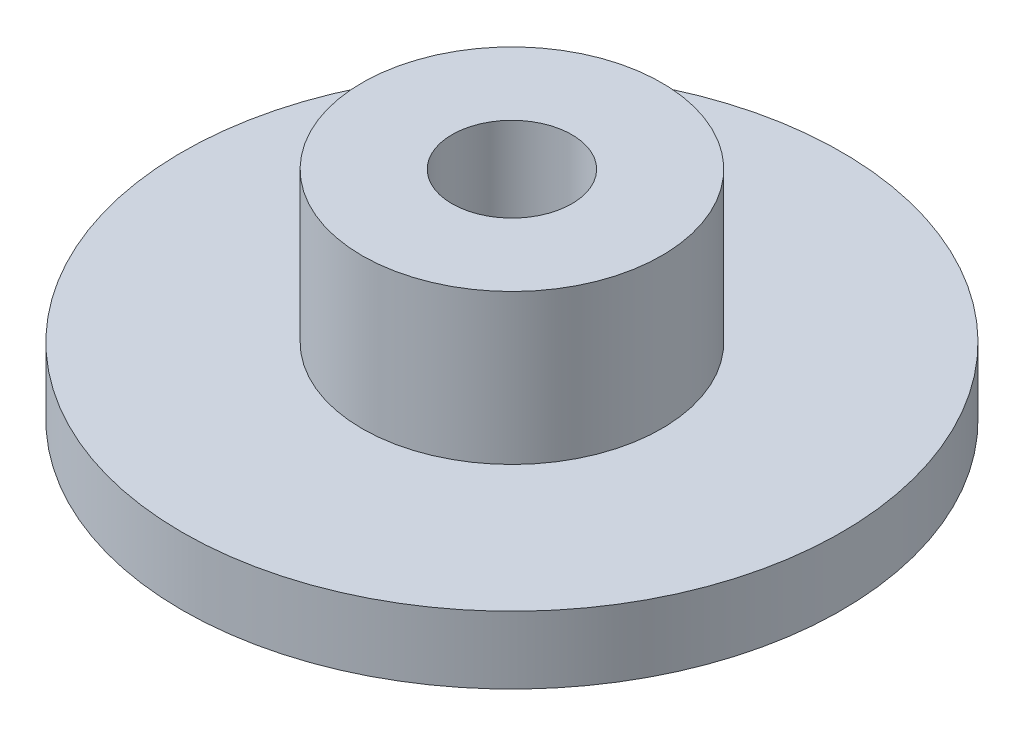
ISO-10303-21;
HEADER;
FILE_DESCRIPTION(('STEP AP214'),'2;1');
FILE_NAME('part.step','',(''),(''),'','','');
FILE_SCHEMA(('AUTOMOTIVE_DESIGN { 1 0 10303 214 1 1 1 1 }'));
ENDSEC;
DATA;
#1=APPLICATION_CONTEXT('core data for automotive mechanical design processes');
#2=APPLICATION_PROTOCOL_DEFINITION('international standard','automotive_design',2000,#1);
#3=PRODUCT_CONTEXT('',#1,'mechanical');
#4=PRODUCT('Part','Part','',(#3));
#5=PRODUCT_RELATED_PRODUCT_CATEGORY('part','',(#4));
#6=PRODUCT_DEFINITION_FORMATION('','',#4);
#7=PRODUCT_DEFINITION_CONTEXT('part definition',#1,'design');
#8=PRODUCT_DEFINITION('design','',#6,#7);
#9=PRODUCT_DEFINITION_SHAPE('','',#8);
#10=(LENGTH_UNIT() NAMED_UNIT(*) SI_UNIT(.MILLI.,.METRE.));
#11=(NAMED_UNIT(*) PLANE_ANGLE_UNIT() SI_UNIT($,.RADIAN.));
#12=(NAMED_UNIT(*) SI_UNIT($,.STERADIAN.) SOLID_ANGLE_UNIT());
#13=UNCERTAINTY_MEASURE_WITH_UNIT(LENGTH_MEASURE(1.E-05),#10,'distance_accuracy_value','');
#14=(GEOMETRIC_REPRESENTATION_CONTEXT(3) GLOBAL_UNCERTAINTY_ASSIGNED_CONTEXT((#13)) GLOBAL_UNIT_ASSIGNED_CONTEXT((#10,
#11,#12)) REPRESENTATION_CONTEXT('',''));
#15=CARTESIAN_POINT('',(0.,0.,0.));
#16=DIRECTION('',(0.,0.,1.));
#17=DIRECTION('',(1.,0.,0.));
#18=AXIS2_PLACEMENT_3D('',#15,#16,#17);
#19=CARTESIAN_POINT('',(0.,4.49999999999999,0.));
#20=DIRECTION('',(0.,-1.,0.));
#21=DIRECTION('',(0.,0.,-1.));
#22=AXIS2_PLACEMENT_3D('',#19,#20,#21);
#23=CYLINDRICAL_SURFACE('',#22,22.);
#24=CARTESIAN_POINT('',(0.,4.49999999999999,0.));
#25=DIRECTION('',(0.,1.,0.));
#26=DIRECTION('',(0.,0.,1.));
#27=AXIS2_PLACEMENT_3D('',#24,#25,#26);
#28=CIRCLE('',#27,22.);
#29=CARTESIAN_POINT('',(0.,4.49999999999999,22.));
#30=VERTEX_POINT('',#29);
#31=EDGE_CURVE('E41',#30,#30,#28,.T.);
#32=ORIENTED_EDGE('',*,*,#31,.F.);
#33=EDGE_LOOP('',(#32));
#34=FACE_BOUND('',#33,.T.);
#35=CARTESIAN_POINT('',(0.,0.,0.));
#36=DIRECTION('',(0.,1.,0.));
#37=DIRECTION('',(0.,0.,1.));
#38=AXIS2_PLACEMENT_3D('',#35,#36,#37);
#39=CIRCLE('',#38,22.);
#40=CARTESIAN_POINT('',(0.,0.,22.));
#41=VERTEX_POINT('',#40);
#42=EDGE_CURVE('E37',#41,#41,#39,.T.);
#43=ORIENTED_EDGE('',*,*,#42,.T.);
#44=EDGE_LOOP('',(#43));
#45=FACE_BOUND('',#44,.T.);
#46=ADVANCED_FACE('F34',(#34,#45),#23,.T.);
#47=CARTESIAN_POINT('',(0.,4.49999999999999,0.));
#48=DIRECTION('',(0.,1.,0.));
#49=DIRECTION('',(0.,0.,1.));
#50=AXIS2_PLACEMENT_3D('',#47,#48,#49);
#51=PLANE('',#50);
#52=CARTESIAN_POINT('',(0.,4.49999999999999,0.));
#53=DIRECTION('',(0.,1.,0.));
#54=DIRECTION('',(0.,0.,1.));
#55=AXIS2_PLACEMENT_3D('',#52,#53,#54);
#56=CIRCLE('',#55,10.);
#57=CARTESIAN_POINT('',(0.,4.49999999999999,10.));
#58=VERTEX_POINT('',#57);
#59=EDGE_CURVE('E10',#58,#58,#56,.T.);
#60=ORIENTED_EDGE('',*,*,#59,.F.);
#61=EDGE_LOOP('',(#60));
#62=FACE_BOUND('',#61,.T.);
#63=ORIENTED_EDGE('',*,*,#31,.T.);
#64=EDGE_LOOP('',(#63));
#65=FACE_BOUND('',#64,.T.);
#66=ADVANCED_FACE('F73',(#62,#65),#51,.T.);
#67=CARTESIAN_POINT('',(0.,0.,0.));
#68=DIRECTION('',(0.,1.,0.));
#69=DIRECTION('',(0.,0.,1.));
#70=AXIS2_PLACEMENT_3D('',#67,#68,#69);
#71=PLANE('',#70);
#72=CARTESIAN_POINT('',(0.,0.,0.));
#73=DIRECTION('',(0.,1.,0.));
#74=DIRECTION('',(0.,0.,1.));
#75=AXIS2_PLACEMENT_3D('',#72,#73,#74);
#76=CIRCLE('',#75,4.);
#77=CARTESIAN_POINT('',(0.,0.,4.));
#78=VERTEX_POINT('',#77);
#79=EDGE_CURVE('E50',#78,#78,#76,.T.);
#80=ORIENTED_EDGE('',*,*,#79,.T.);
#81=EDGE_LOOP('',(#80));
#82=FACE_BOUND('',#81,.T.);
#83=ORIENTED_EDGE('',*,*,#42,.F.);
#84=EDGE_LOOP('',(#83));
#85=FACE_BOUND('',#84,.T.);
#86=ADVANCED_FACE('F68',(#82,#85),#71,.F.);
#87=CARTESIAN_POINT('',(0.,14.5,0.));
#88=DIRECTION('',(0.,-1.,0.));
#89=DIRECTION('',(0.,0.,-1.));
#90=AXIS2_PLACEMENT_3D('',#87,#88,#89);
#91=CYLINDRICAL_SURFACE('',#90,10.);
#92=CARTESIAN_POINT('',(0.,14.5,0.));
#93=DIRECTION('',(0.,1.,0.));
#94=DIRECTION('',(0.,0.,1.));
#95=AXIS2_PLACEMENT_3D('',#92,#93,#94);
#96=CIRCLE('',#95,10.);
#97=CARTESIAN_POINT('',(0.,14.5,10.));
#98=VERTEX_POINT('',#97);
#99=EDGE_CURVE('E47',#98,#98,#96,.T.);
#100=ORIENTED_EDGE('',*,*,#99,.F.);
#101=EDGE_LOOP('',(#100));
#102=FACE_BOUND('',#101,.T.);
#103=ORIENTED_EDGE('',*,*,#59,.T.);
#104=EDGE_LOOP('',(#103));
#105=FACE_BOUND('',#104,.T.);
#106=ADVANCED_FACE('F63',(#102,#105),#91,.T.);
#107=CARTESIAN_POINT('',(0.,14.5,0.));
#108=DIRECTION('',(0.,1.,0.));
#109=DIRECTION('',(0.,0.,1.));
#110=AXIS2_PLACEMENT_3D('',#107,#108,#109);
#111=PLANE('',#110);
#112=CARTESIAN_POINT('',(0.,14.5,0.));
#113=DIRECTION('',(0.,1.,0.));
#114=DIRECTION('',(0.,0.,1.));
#115=AXIS2_PLACEMENT_3D('',#112,#113,#114);
#116=CIRCLE('',#115,4.);
#117=CARTESIAN_POINT('',(0.,14.5,4.));
#118=VERTEX_POINT('',#117);
#119=EDGE_CURVE('E53',#118,#118,#116,.T.);
#120=ORIENTED_EDGE('',*,*,#119,.F.);
#121=EDGE_LOOP('',(#120));
#122=FACE_BOUND('',#121,.T.);
#123=ORIENTED_EDGE('',*,*,#99,.T.);
#124=EDGE_LOOP('',(#123));
#125=FACE_BOUND('',#124,.T.);
#126=ADVANCED_FACE('F60',(#122,#125),#111,.T.);
#127=CARTESIAN_POINT('',(0.,-0.500000000000006,0.));
#128=DIRECTION('',(0.,1.,0.));
#129=DIRECTION('',(0.,0.,1.));
#130=AXIS2_PLACEMENT_3D('',#127,#128,#129);
#131=CYLINDRICAL_SURFACE('',#130,4.);
#132=ORIENTED_EDGE('',*,*,#119,.T.);
#133=EDGE_LOOP('',(#132));
#134=FACE_BOUND('',#133,.T.);
#135=ORIENTED_EDGE('',*,*,#79,.F.);
#136=EDGE_LOOP('',(#135));
#137=FACE_BOUND('',#136,.T.);
#138=ADVANCED_FACE('F57',(#134,#137),#131,.F.);
#139=CLOSED_SHELL('',(#46,#66,#86,#106,#126,#138));
#140=MANIFOLD_SOLID_BREP('B2',#139);
#141=ADVANCED_BREP_SHAPE_REPRESENTATION('',(#18,#140),#14);
#142=SHAPE_DEFINITION_REPRESENTATION(#9,#141);
ENDSEC;
END-ISO-10303-21;
